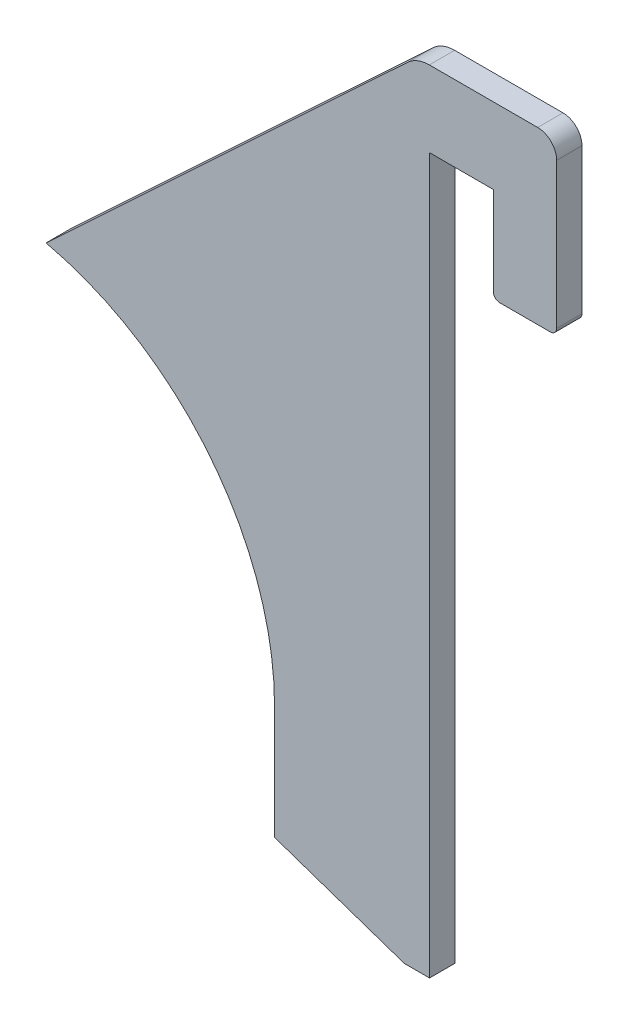
ISO-10303-21;
HEADER;
FILE_DESCRIPTION(('STEP AP214'),'2;1');
FILE_NAME('part.step','',(''),(''),'','','');
FILE_SCHEMA(('AUTOMOTIVE_DESIGN { 1 0 10303 214 1 1 1 1 }'));
ENDSEC;
DATA;
#1=APPLICATION_CONTEXT('core data for automotive mechanical design processes');
#2=APPLICATION_PROTOCOL_DEFINITION('international standard','automotive_design',2000,#1);
#3=PRODUCT_CONTEXT('',#1,'mechanical');
#4=PRODUCT('Part','Part','',(#3));
#5=PRODUCT_RELATED_PRODUCT_CATEGORY('part','',(#4));
#6=PRODUCT_DEFINITION_FORMATION('','',#4);
#7=PRODUCT_DEFINITION_CONTEXT('part definition',#1,'design');
#8=PRODUCT_DEFINITION('design','',#6,#7);
#9=PRODUCT_DEFINITION_SHAPE('','',#8);
#10=(LENGTH_UNIT() NAMED_UNIT(*) SI_UNIT(.MILLI.,.METRE.));
#11=(NAMED_UNIT(*) PLANE_ANGLE_UNIT() SI_UNIT($,.RADIAN.));
#12=(NAMED_UNIT(*) SI_UNIT($,.STERADIAN.) SOLID_ANGLE_UNIT());
#13=UNCERTAINTY_MEASURE_WITH_UNIT(LENGTH_MEASURE(1.E-05),#10,'distance_accuracy_value','');
#14=(GEOMETRIC_REPRESENTATION_CONTEXT(3) GLOBAL_UNCERTAINTY_ASSIGNED_CONTEXT((#13)) GLOBAL_UNIT_ASSIGNED_CONTEXT((#10,
#11,#12)) REPRESENTATION_CONTEXT('',''));
#15=CARTESIAN_POINT('',(0.,0.,0.));
#16=DIRECTION('',(0.,0.,1.));
#17=DIRECTION('',(1.,0.,0.));
#18=AXIS2_PLACEMENT_3D('',#15,#16,#17);
#19=CARTESIAN_POINT('',(69.,100.,4.));
#20=DIRECTION('',(0.681998360062503,-0.731353701619167,0.));
#21=DIRECTION('',(0.731353701619167,0.681998360062503,0.));
#22=AXIS2_PLACEMENT_3D('',#19,#20,#21);
#23=PLANE('',#22);
#24=DIRECTION('',(-0.731353701619166,-0.681998360062503,0.));
#25=VECTOR('',#24,1.);
#26=CARTESIAN_POINT('',(69.,100.,4.));
#27=LINE('',#26,#25);
#28=CARTESIAN_POINT('',(67.5595605777622,98.6567685080958,4.));
#29=VERTEX_POINT('',#28);
#30=CARTESIAN_POINT('',(10.3719829262458,45.3284896083872,4.));
#31=VERTEX_POINT('',#30);
#32=EDGE_CURVE('E144',#29,#31,#27,.T.);
#33=ORIENTED_EDGE('',*,*,#32,.F.);
#34=DIRECTION('',(0.,0.,-1.));
#35=VECTOR('',#34,1.);
#36=CARTESIAN_POINT('',(67.5595605777622,98.6567685080958,4.));
#37=LINE('',#36,#35);
#38=CARTESIAN_POINT('',(67.5595605777622,98.6567685080958,0.));
#39=VERTEX_POINT('',#38);
#40=EDGE_CURVE('E12',#29,#39,#37,.T.);
#41=ORIENTED_EDGE('',*,*,#40,.T.);
#42=DIRECTION('',(-0.731353701619166,-0.681998360062503,0.));
#43=VECTOR('',#42,1.);
#44=CARTESIAN_POINT('',(69.,100.,0.));
#45=LINE('',#44,#43);
#46=CARTESIAN_POINT('',(10.3719829262458,45.3284896083872,0.));
#47=VERTEX_POINT('',#46);
#48=EDGE_CURVE('E167',#39,#47,#45,.T.);
#49=ORIENTED_EDGE('',*,*,#48,.T.);
#50=DIRECTION('',(0.,0.,-1.));
#51=VECTOR('',#50,1.);
#52=CARTESIAN_POINT('',(10.3719829262458,45.3284896083872,4.));
#53=LINE('',#52,#51);
#54=EDGE_CURVE('E160',#31,#47,#53,.T.);
#55=ORIENTED_EDGE('',*,*,#54,.F.);
#56=EDGE_LOOP('',(#33,#41,#49,#55));
#57=FACE_BOUND('',#56,.T.);
#58=ADVANCED_FACE('F37',(#57),#23,.F.);
#59=CARTESIAN_POINT('',(0.,0.,4.));
#60=DIRECTION('',(0.,0.,-1.));
#61=DIRECTION('',(-1.,0.,0.));
#62=AXIS2_PLACEMENT_3D('',#59,#60,#61);
#63=CYLINDRICAL_SURFACE('',#62,46.5);
#64=CARTESIAN_POINT('',(0.,0.,0.));
#65=DIRECTION('',(0.,0.,-1.));
#66=DIRECTION('',(-1.,0.,0.));
#67=AXIS2_PLACEMENT_3D('',#64,#65,#66);
#68=CIRCLE('',#67,46.5);
#69=CARTESIAN_POINT('',(46.5,0.,0.));
#70=VERTEX_POINT('',#69);
#71=EDGE_CURVE('E241',#47,#70,#68,.T.);
#72=ORIENTED_EDGE('',*,*,#71,.T.);
#73=DIRECTION('',(0.,0.,-1.));
#74=VECTOR('',#73,1.);
#75=CARTESIAN_POINT('',(46.5,0.,4.));
#76=LINE('',#75,#74);
#77=CARTESIAN_POINT('',(46.5,0.,4.));
#78=VERTEX_POINT('',#77);
#79=EDGE_CURVE('E162',#78,#70,#76,.T.);
#80=ORIENTED_EDGE('',*,*,#79,.F.);
#81=CARTESIAN_POINT('',(0.,0.,4.));
#82=DIRECTION('',(0.,0.,-1.));
#83=DIRECTION('',(-1.,0.,0.));
#84=AXIS2_PLACEMENT_3D('',#81,#82,#83);
#85=CIRCLE('',#84,46.5);
#86=EDGE_CURVE('E148',#31,#78,#85,.T.);
#87=ORIENTED_EDGE('',*,*,#86,.F.);
#88=ORIENTED_EDGE('',*,*,#54,.T.);
#89=EDGE_LOOP('',(#72,#80,#87,#88));
#90=FACE_BOUND('',#89,.T.);
#91=ADVANCED_FACE('F159',(#90),#63,.F.);
#92=CARTESIAN_POINT('',(46.5,0.,4.));
#93=DIRECTION('',(1.,0.,0.));
#94=DIRECTION('',(0.,1.,0.));
#95=AXIS2_PLACEMENT_3D('',#92,#93,#94);
#96=PLANE('',#95);
#97=DIRECTION('',(0.,-1.,0.));
#98=VECTOR('',#97,1.);
#99=CARTESIAN_POINT('',(46.5,0.,0.));
#100=LINE('',#99,#98);
#101=CARTESIAN_POINT('',(46.5,-18.,0.));
#102=VERTEX_POINT('',#101);
#103=EDGE_CURVE('E239',#70,#102,#100,.T.);
#104=ORIENTED_EDGE('',*,*,#103,.T.);
#105=DIRECTION('',(0.,0.,-1.));
#106=VECTOR('',#105,1.);
#107=CARTESIAN_POINT('',(46.5,-18.,4.));
#108=LINE('',#107,#106);
#109=CARTESIAN_POINT('',(46.5,-18.,4.));
#110=VERTEX_POINT('',#109);
#111=EDGE_CURVE('E173',#110,#102,#108,.T.);
#112=ORIENTED_EDGE('',*,*,#111,.F.);
#113=DIRECTION('',(0.,-1.,0.));
#114=VECTOR('',#113,1.);
#115=CARTESIAN_POINT('',(46.5,0.,4.));
#116=LINE('',#115,#114);
#117=EDGE_CURVE('E164',#78,#110,#116,.T.);
#118=ORIENTED_EDGE('',*,*,#117,.F.);
#119=ORIENTED_EDGE('',*,*,#79,.T.);
#120=EDGE_LOOP('',(#104,#112,#118,#119));
#121=FACE_BOUND('',#120,.T.);
#122=ADVANCED_FACE('F240',(#121),#96,.F.);
#123=CARTESIAN_POINT('',(67.,-25.,4.));
#124=DIRECTION('',(-0.323143853291512,-0.946349856067994,0.));
#125=DIRECTION('',(0.946349856067995,-0.323143853291512,0.));
#126=AXIS2_PLACEMENT_3D('',#123,#124,#125);
#127=PLANE('',#126);
#128=DIRECTION('',(-0.946349856067994,0.323143853291512,0.));
#129=VECTOR('',#128,1.);
#130=CARTESIAN_POINT('',(67.,-25.,0.));
#131=LINE('',#130,#129);
#132=CARTESIAN_POINT('',(67.,-25.,0.));
#133=VERTEX_POINT('',#132);
#134=EDGE_CURVE('E234',#133,#102,#131,.T.);
#135=ORIENTED_EDGE('',*,*,#134,.F.);
#136=DIRECTION('',(0.,0.,-1.));
#137=VECTOR('',#136,1.);
#138=CARTESIAN_POINT('',(67.,-25.,4.));
#139=LINE('',#138,#137);
#140=CARTESIAN_POINT('',(67.,-25.,4.));
#141=VERTEX_POINT('',#140);
#142=EDGE_CURVE('E226',#141,#133,#139,.T.);
#143=ORIENTED_EDGE('',*,*,#142,.F.);
#144=DIRECTION('',(-0.946349856067994,0.323143853291512,0.));
#145=VECTOR('',#144,1.);
#146=CARTESIAN_POINT('',(67.,-25.,4.));
#147=LINE('',#146,#145);
#148=EDGE_CURVE('E236',#141,#110,#147,.T.);
#149=ORIENTED_EDGE('',*,*,#148,.T.);
#150=ORIENTED_EDGE('',*,*,#111,.T.);
#151=EDGE_LOOP('',(#135,#143,#149,#150));
#152=FACE_BOUND('',#151,.T.);
#153=ADVANCED_FACE('F232',(#152),#127,.T.);
#154=CARTESIAN_POINT('',(67.,-25.,4.));
#155=DIRECTION('',(0.,1.,0.));
#156=DIRECTION('',(-1.,0.,0.));
#157=AXIS2_PLACEMENT_3D('',#154,#155,#156);
#158=PLANE('',#157);
#159=DIRECTION('',(1.,0.,0.));
#160=VECTOR('',#159,1.);
#161=CARTESIAN_POINT('',(67.,-25.,0.));
#162=LINE('',#161,#160);
#163=CARTESIAN_POINT('',(71.,-25.,0.));
#164=VERTEX_POINT('',#163);
#165=EDGE_CURVE('E245',#133,#164,#162,.T.);
#166=ORIENTED_EDGE('',*,*,#165,.T.);
#167=DIRECTION('',(0.,0.,-1.));
#168=VECTOR('',#167,1.);
#169=CARTESIAN_POINT('',(71.,-25.,4.));
#170=LINE('',#169,#168);
#171=CARTESIAN_POINT('',(71.,-25.,4.));
#172=VERTEX_POINT('',#171);
#173=EDGE_CURVE('E223',#172,#164,#170,.T.);
#174=ORIENTED_EDGE('',*,*,#173,.F.);
#175=DIRECTION('',(1.,0.,0.));
#176=VECTOR('',#175,1.);
#177=CARTESIAN_POINT('',(67.,-25.,4.));
#178=LINE('',#177,#176);
#179=EDGE_CURVE('E284',#141,#172,#178,.T.);
#180=ORIENTED_EDGE('',*,*,#179,.F.);
#181=ORIENTED_EDGE('',*,*,#142,.T.);
#182=EDGE_LOOP('',(#166,#174,#180,#181));
#183=FACE_BOUND('',#182,.T.);
#184=ADVANCED_FACE('F292',(#183),#158,.F.);
#185=CARTESIAN_POINT('',(71.,-25.,4.));
#186=DIRECTION('',(-1.,0.,0.));
#187=DIRECTION('',(0.,0.,1.));
#188=AXIS2_PLACEMENT_3D('',#185,#186,#187);
#189=PLANE('',#188);
#190=DIRECTION('',(0.,1.,0.));
#191=VECTOR('',#190,1.);
#192=CARTESIAN_POINT('',(71.,-25.,0.));
#193=LINE('',#192,#191);
#194=CARTESIAN_POINT('',(71.,88.,0.));
#195=VERTEX_POINT('',#194);
#196=EDGE_CURVE('E247',#164,#195,#193,.T.);
#197=ORIENTED_EDGE('',*,*,#196,.T.);
#198=DIRECTION('',(0.,0.,-1.));
#199=VECTOR('',#198,1.);
#200=CARTESIAN_POINT('',(71.,88.,4.));
#201=LINE('',#200,#199);
#202=CARTESIAN_POINT('',(71.,88.,4.));
#203=VERTEX_POINT('',#202);
#204=EDGE_CURVE('E220',#203,#195,#201,.T.);
#205=ORIENTED_EDGE('',*,*,#204,.F.);
#206=DIRECTION('',(0.,1.,0.));
#207=VECTOR('',#206,1.);
#208=CARTESIAN_POINT('',(71.,-25.,4.));
#209=LINE('',#208,#207);
#210=EDGE_CURVE('E282',#172,#203,#209,.T.);
#211=ORIENTED_EDGE('',*,*,#210,.F.);
#212=ORIENTED_EDGE('',*,*,#173,.T.);
#213=EDGE_LOOP('',(#197,#205,#211,#212));
#214=FACE_BOUND('',#213,.T.);
#215=ADVANCED_FACE('F294',(#214),#189,.F.);
#216=CARTESIAN_POINT('',(71.,88.,4.));
#217=DIRECTION('',(0.,1.,0.));
#218=DIRECTION('',(0.,0.,1.));
#219=AXIS2_PLACEMENT_3D('',#216,#217,#218);
#220=PLANE('',#219);
#221=DIRECTION('',(1.,0.,0.));
#222=VECTOR('',#221,1.);
#223=CARTESIAN_POINT('',(71.,88.,0.));
#224=LINE('',#223,#222);
#225=CARTESIAN_POINT('',(81.1,88.,0.));
#226=VERTEX_POINT('',#225);
#227=EDGE_CURVE('E252',#195,#226,#224,.T.);
#228=ORIENTED_EDGE('',*,*,#227,.T.);
#229=DIRECTION('',(0.,0.,-1.));
#230=VECTOR('',#229,1.);
#231=CARTESIAN_POINT('',(81.1,88.,4.));
#232=LINE('',#231,#230);
#233=CARTESIAN_POINT('',(81.1,88.,4.));
#234=VERTEX_POINT('',#233);
#235=EDGE_CURVE('E217',#234,#226,#232,.T.);
#236=ORIENTED_EDGE('',*,*,#235,.F.);
#237=DIRECTION('',(1.,0.,0.));
#238=VECTOR('',#237,1.);
#239=CARTESIAN_POINT('',(71.,88.,4.));
#240=LINE('',#239,#238);
#241=EDGE_CURVE('E280',#203,#234,#240,.T.);
#242=ORIENTED_EDGE('',*,*,#241,.F.);
#243=ORIENTED_EDGE('',*,*,#204,.T.);
#244=EDGE_LOOP('',(#228,#236,#242,#243));
#245=FACE_BOUND('',#244,.T.);
#246=ADVANCED_FACE('F299',(#245),#220,.F.);
#247=CARTESIAN_POINT('',(81.1,88.,4.));
#248=DIRECTION('',(1.,0.,0.));
#249=DIRECTION('',(0.,0.,-1.));
#250=AXIS2_PLACEMENT_3D('',#247,#248,#249);
#251=PLANE('',#250);
#252=DIRECTION('',(0.,-1.,0.));
#253=VECTOR('',#252,1.);
#254=CARTESIAN_POINT('',(81.1,88.,0.));
#255=LINE('',#254,#253);
#256=CARTESIAN_POINT('',(81.1,74.,0.));
#257=VERTEX_POINT('',#256);
#258=EDGE_CURVE('E254',#226,#257,#255,.T.);
#259=ORIENTED_EDGE('',*,*,#258,.T.);
#260=DIRECTION('',(0.,0.,-1.));
#261=VECTOR('',#260,1.);
#262=CARTESIAN_POINT('',(81.1,74.,4.));
#263=LINE('',#262,#261);
#264=CARTESIAN_POINT('',(81.1,74.,4.));
#265=VERTEX_POINT('',#264);
#266=EDGE_CURVE('E187',#257,#265,#263,.F.);
#267=ORIENTED_EDGE('',*,*,#266,.T.);
#268=DIRECTION('',(0.,-1.,0.));
#269=VECTOR('',#268,1.);
#270=CARTESIAN_POINT('',(81.1,88.,4.));
#271=LINE('',#270,#269);
#272=EDGE_CURVE('E275',#234,#265,#271,.T.);
#273=ORIENTED_EDGE('',*,*,#272,.F.);
#274=ORIENTED_EDGE('',*,*,#235,.T.);
#275=EDGE_LOOP('',(#259,#267,#273,#274));
#276=FACE_BOUND('',#275,.T.);
#277=ADVANCED_FACE('F307',(#276),#251,.F.);
#278=CARTESIAN_POINT('',(81.1,73.,4.));
#279=DIRECTION('',(0.,1.,0.));
#280=DIRECTION('',(-1.,0.,0.));
#281=AXIS2_PLACEMENT_3D('',#278,#279,#280);
#282=PLANE('',#281);
#283=DIRECTION('',(1.,0.,0.));
#284=VECTOR('',#283,1.);
#285=CARTESIAN_POINT('',(81.1,73.,4.));
#286=LINE('',#285,#284);
#287=CARTESIAN_POINT('',(82.1,73.,4.));
#288=VERTEX_POINT('',#287);
#289=CARTESIAN_POINT('',(90.1,73.,4.));
#290=VERTEX_POINT('',#289);
#291=EDGE_CURVE('E269',#288,#290,#286,.T.);
#292=ORIENTED_EDGE('',*,*,#291,.F.);
#293=DIRECTION('',(0.,0.,-1.));
#294=VECTOR('',#293,1.);
#295=CARTESIAN_POINT('',(82.1,73.,4.));
#296=LINE('',#295,#294);
#297=CARTESIAN_POINT('',(82.1,73.,0.));
#298=VERTEX_POINT('',#297);
#299=EDGE_CURVE('E171',#288,#298,#296,.T.);
#300=ORIENTED_EDGE('',*,*,#299,.T.);
#301=DIRECTION('',(1.,0.,0.));
#302=VECTOR('',#301,1.);
#303=CARTESIAN_POINT('',(81.1,73.,0.));
#304=LINE('',#303,#302);
#305=CARTESIAN_POINT('',(90.1,73.,0.));
#306=VERTEX_POINT('',#305);
#307=EDGE_CURVE('E213',#298,#306,#304,.T.);
#308=ORIENTED_EDGE('',*,*,#307,.T.);
#309=DIRECTION('',(0.,0.,-1.));
#310=VECTOR('',#309,1.);
#311=CARTESIAN_POINT('',(90.1,73.,4.));
#312=LINE('',#311,#310);
#313=EDGE_CURVE('E169',#306,#290,#312,.F.);
#314=ORIENTED_EDGE('',*,*,#313,.T.);
#315=EDGE_LOOP('',(#292,#300,#308,#314));
#316=FACE_BOUND('',#315,.T.);
#317=ADVANCED_FACE('F260',(#316),#282,.F.);
#318=CARTESIAN_POINT('',(91.1,73.,4.));
#319=DIRECTION('',(-1.,0.,0.));
#320=DIRECTION('',(0.,0.,1.));
#321=AXIS2_PLACEMENT_3D('',#318,#319,#320);
#322=PLANE('',#321);
#323=DIRECTION('',(0.,1.,0.));
#324=VECTOR('',#323,1.);
#325=CARTESIAN_POINT('',(91.1,73.,4.));
#326=LINE('',#325,#324);
#327=CARTESIAN_POINT('',(91.1,74.,4.));
#328=VERTEX_POINT('',#327);
#329=CARTESIAN_POINT('',(91.1,97.,4.));
#330=VERTEX_POINT('',#329);
#331=EDGE_CURVE('E268',#328,#330,#326,.T.);
#332=ORIENTED_EDGE('',*,*,#331,.F.);
#333=DIRECTION('',(0.,0.,-1.));
#334=VECTOR('',#333,1.);
#335=CARTESIAN_POINT('',(91.1,74.,4.));
#336=LINE('',#335,#334);
#337=CARTESIAN_POINT('',(91.1,74.,0.));
#338=VERTEX_POINT('',#337);
#339=EDGE_CURVE('E197',#328,#338,#336,.T.);
#340=ORIENTED_EDGE('',*,*,#339,.T.);
#341=DIRECTION('',(0.,1.,0.));
#342=VECTOR('',#341,1.);
#343=CARTESIAN_POINT('',(91.1,73.,0.));
#344=LINE('',#343,#342);
#345=CARTESIAN_POINT('',(91.1,97.,0.));
#346=VERTEX_POINT('',#345);
#347=EDGE_CURVE('E211',#338,#346,#344,.T.);
#348=ORIENTED_EDGE('',*,*,#347,.T.);
#349=DIRECTION('',(0.,0.,-1.));
#350=VECTOR('',#349,1.);
#351=CARTESIAN_POINT('',(91.1,97.,4.));
#352=LINE('',#351,#350);
#353=EDGE_CURVE('E195',#346,#330,#352,.F.);
#354=ORIENTED_EDGE('',*,*,#353,.T.);
#355=EDGE_LOOP('',(#332,#340,#348,#354));
#356=FACE_BOUND('',#355,.T.);
#357=ADVANCED_FACE('F271',(#356),#322,.F.);
#358=CARTESIAN_POINT('',(91.1,100.,4.));
#359=DIRECTION('',(0.,-1.,0.));
#360=DIRECTION('',(1.,0.,0.));
#361=AXIS2_PLACEMENT_3D('',#358,#359,#360);
#362=PLANE('',#361);
#363=DIRECTION('',(-1.,0.,0.));
#364=VECTOR('',#363,1.);
#365=CARTESIAN_POINT('',(91.1,100.,4.));
#366=LINE('',#365,#364);
#367=CARTESIAN_POINT('',(88.1,100.,4.));
#368=VERTEX_POINT('',#367);
#369=CARTESIAN_POINT('',(70.9695523780747,100.,4.));
#370=VERTEX_POINT('',#369);
#371=EDGE_CURVE('E204',#368,#370,#366,.T.);
#372=ORIENTED_EDGE('',*,*,#371,.F.);
#373=DIRECTION('',(0.,0.,-1.));
#374=VECTOR('',#373,1.);
#375=CARTESIAN_POINT('',(88.1,100.,4.));
#376=LINE('',#375,#374);
#377=CARTESIAN_POINT('',(88.1,100.,0.));
#378=VERTEX_POINT('',#377);
#379=EDGE_CURVE('E45',#368,#378,#376,.T.);
#380=ORIENTED_EDGE('',*,*,#379,.T.);
#381=DIRECTION('',(-1.,0.,0.));
#382=VECTOR('',#381,1.);
#383=CARTESIAN_POINT('',(91.1,100.,0.));
#384=LINE('',#383,#382);
#385=CARTESIAN_POINT('',(70.9695523780747,100.,0.));
#386=VERTEX_POINT('',#385);
#387=EDGE_CURVE('E155',#378,#386,#384,.T.);
#388=ORIENTED_EDGE('',*,*,#387,.T.);
#389=DIRECTION('',(0.,0.,-1.));
#390=VECTOR('',#389,1.);
#391=CARTESIAN_POINT('',(70.9695523780747,100.,4.));
#392=LINE('',#391,#390);
#393=EDGE_CURVE('E52',#386,#370,#392,.F.);
#394=ORIENTED_EDGE('',*,*,#393,.T.);
#395=EDGE_LOOP('',(#372,#380,#388,#394));
#396=FACE_BOUND('',#395,.T.);
#397=ADVANCED_FACE('F203',(#396),#362,.F.);
#398=CARTESIAN_POINT('',(0.,0.,4.));
#399=DIRECTION('',(0.,0.,-1.));
#400=DIRECTION('',(-1.,0.,0.));
#401=AXIS2_PLACEMENT_3D('',#398,#399,#400);
#402=PLANE('',#401);
#403=ORIENTED_EDGE('',*,*,#272,.T.);
#404=CARTESIAN_POINT('',(82.1,74.,4.));
#405=DIRECTION('',(0.,0.,-1.));
#406=DIRECTION('',(-1.,0.,0.));
#407=AXIS2_PLACEMENT_3D('',#404,#405,#406);
#408=CIRCLE('',#407,1.);
#409=EDGE_CURVE('E193',#265,#288,#408,.F.);
#410=ORIENTED_EDGE('',*,*,#409,.T.);
#411=ORIENTED_EDGE('',*,*,#291,.T.);
#412=CARTESIAN_POINT('',(90.1,74.,4.));
#413=DIRECTION('',(0.,0.,-1.));
#414=DIRECTION('',(-1.,0.,0.));
#415=AXIS2_PLACEMENT_3D('',#412,#413,#414);
#416=CIRCLE('',#415,1.);
#417=EDGE_CURVE('E191',#290,#328,#416,.F.);
#418=ORIENTED_EDGE('',*,*,#417,.T.);
#419=ORIENTED_EDGE('',*,*,#331,.T.);
#420=CARTESIAN_POINT('',(88.1,97.,4.));
#421=DIRECTION('',(0.,0.,-1.));
#422=DIRECTION('',(-1.,0.,0.));
#423=AXIS2_PLACEMENT_3D('',#420,#421,#422);
#424=CIRCLE('',#423,3.);
#425=EDGE_CURVE('E59',#330,#368,#424,.F.);
#426=ORIENTED_EDGE('',*,*,#425,.T.);
#427=ORIENTED_EDGE('',*,*,#371,.T.);
#428=CARTESIAN_POINT('',(70.9695523780747,95.,4.));
#429=DIRECTION('',(0.,0.,-1.));
#430=DIRECTION('',(-1.,0.,0.));
#431=AXIS2_PLACEMENT_3D('',#428,#429,#430);
#432=CIRCLE('',#431,5.);
#433=EDGE_CURVE('E151',#370,#29,#432,.F.);
#434=ORIENTED_EDGE('',*,*,#433,.T.);
#435=ORIENTED_EDGE('',*,*,#32,.T.);
#436=ORIENTED_EDGE('',*,*,#86,.T.);
#437=ORIENTED_EDGE('',*,*,#117,.T.);
#438=ORIENTED_EDGE('',*,*,#148,.F.);
#439=ORIENTED_EDGE('',*,*,#179,.T.);
#440=ORIENTED_EDGE('',*,*,#210,.T.);
#441=ORIENTED_EDGE('',*,*,#241,.T.);
#442=EDGE_LOOP('',(#403,#410,#411,#418,#419,#426,#427,#434,#435,#436,#437,#438,#439,#440,#441));
#443=FACE_BOUND('',#442,.T.);
#444=ADVANCED_FACE('F147',(#443),#402,.F.);
#445=CARTESIAN_POINT('',(0.,0.,0.));
#446=DIRECTION('',(0.,0.,-1.));
#447=DIRECTION('',(-1.,0.,0.));
#448=AXIS2_PLACEMENT_3D('',#445,#446,#447);
#449=PLANE('',#448);
#450=ORIENTED_EDGE('',*,*,#307,.F.);
#451=CARTESIAN_POINT('',(82.1,74.,0.));
#452=DIRECTION('',(0.,0.,-1.));
#453=DIRECTION('',(-1.,0.,0.));
#454=AXIS2_PLACEMENT_3D('',#451,#452,#453);
#455=CIRCLE('',#454,1.);
#456=EDGE_CURVE('E185',#298,#257,#455,.T.);
#457=ORIENTED_EDGE('',*,*,#456,.T.);
#458=ORIENTED_EDGE('',*,*,#258,.F.);
#459=ORIENTED_EDGE('',*,*,#227,.F.);
#460=ORIENTED_EDGE('',*,*,#196,.F.);
#461=ORIENTED_EDGE('',*,*,#165,.F.);
#462=ORIENTED_EDGE('',*,*,#134,.T.);
#463=ORIENTED_EDGE('',*,*,#103,.F.);
#464=ORIENTED_EDGE('',*,*,#71,.F.);
#465=ORIENTED_EDGE('',*,*,#48,.F.);
#466=CARTESIAN_POINT('',(70.9695523780747,95.,0.));
#467=DIRECTION('',(0.,0.,-1.));
#468=DIRECTION('',(-1.,0.,0.));
#469=AXIS2_PLACEMENT_3D('',#466,#467,#468);
#470=CIRCLE('',#469,5.);
#471=EDGE_CURVE('E179',#39,#386,#470,.T.);
#472=ORIENTED_EDGE('',*,*,#471,.T.);
#473=ORIENTED_EDGE('',*,*,#387,.F.);
#474=CARTESIAN_POINT('',(88.1,97.,0.));
#475=DIRECTION('',(0.,0.,-1.));
#476=DIRECTION('',(-1.,0.,0.));
#477=AXIS2_PLACEMENT_3D('',#474,#475,#476);
#478=CIRCLE('',#477,3.);
#479=EDGE_CURVE('E181',#378,#346,#478,.T.);
#480=ORIENTED_EDGE('',*,*,#479,.T.);
#481=ORIENTED_EDGE('',*,*,#347,.F.);
#482=CARTESIAN_POINT('',(90.1,74.,0.));
#483=DIRECTION('',(0.,0.,-1.));
#484=DIRECTION('',(-1.,0.,0.));
#485=AXIS2_PLACEMENT_3D('',#482,#483,#484);
#486=CIRCLE('',#485,1.);
#487=EDGE_CURVE('E183',#338,#306,#486,.T.);
#488=ORIENTED_EDGE('',*,*,#487,.T.);
#489=EDGE_LOOP('',(#450,#457,#458,#459,#460,#461,#462,#463,#464,#465,#472,#473,#480,#481,#488));
#490=FACE_BOUND('',#489,.T.);
#491=ADVANCED_FACE('F208',(#490),#449,.T.);
#492=CARTESIAN_POINT('',(82.1,74.,4.));
#493=DIRECTION('',(0.,0.,-1.));
#494=DIRECTION('',(-1.,0.,0.));
#495=AXIS2_PLACEMENT_3D('',#492,#493,#494);
#496=CYLINDRICAL_SURFACE('',#495,1.);
#497=ORIENTED_EDGE('',*,*,#409,.F.);
#498=ORIENTED_EDGE('',*,*,#266,.F.);
#499=ORIENTED_EDGE('',*,*,#456,.F.);
#500=ORIENTED_EDGE('',*,*,#299,.F.);
#501=EDGE_LOOP('',(#497,#498,#499,#500));
#502=FACE_BOUND('',#501,.T.);
#503=ADVANCED_FACE('F305',(#502),#496,.T.);
#504=CARTESIAN_POINT('',(90.1,74.,4.));
#505=DIRECTION('',(0.,0.,-1.));
#506=DIRECTION('',(-1.,0.,0.));
#507=AXIS2_PLACEMENT_3D('',#504,#505,#506);
#508=CYLINDRICAL_SURFACE('',#507,1.);
#509=ORIENTED_EDGE('',*,*,#417,.F.);
#510=ORIENTED_EDGE('',*,*,#313,.F.);
#511=ORIENTED_EDGE('',*,*,#487,.F.);
#512=ORIENTED_EDGE('',*,*,#339,.F.);
#513=EDGE_LOOP('',(#509,#510,#511,#512));
#514=FACE_BOUND('',#513,.T.);
#515=ADVANCED_FACE('F265',(#514),#508,.T.);
#516=CARTESIAN_POINT('',(88.1,97.,4.));
#517=DIRECTION('',(0.,0.,-1.));
#518=DIRECTION('',(-1.,0.,0.));
#519=AXIS2_PLACEMENT_3D('',#516,#517,#518);
#520=CYLINDRICAL_SURFACE('',#519,3.);
#521=ORIENTED_EDGE('',*,*,#425,.F.);
#522=ORIENTED_EDGE('',*,*,#353,.F.);
#523=ORIENTED_EDGE('',*,*,#479,.F.);
#524=ORIENTED_EDGE('',*,*,#379,.F.);
#525=EDGE_LOOP('',(#521,#522,#523,#524));
#526=FACE_BOUND('',#525,.T.);
#527=ADVANCED_FACE('F327',(#526),#520,.T.);
#528=CARTESIAN_POINT('',(70.9695523780747,95.,4.));
#529=DIRECTION('',(0.,0.,-1.));
#530=DIRECTION('',(-1.,0.,0.));
#531=AXIS2_PLACEMENT_3D('',#528,#529,#530);
#532=CYLINDRICAL_SURFACE('',#531,5.);
#533=ORIENTED_EDGE('',*,*,#433,.F.);
#534=ORIENTED_EDGE('',*,*,#393,.F.);
#535=ORIENTED_EDGE('',*,*,#471,.F.);
#536=ORIENTED_EDGE('',*,*,#40,.F.);
#537=EDGE_LOOP('',(#533,#534,#535,#536));
#538=FACE_BOUND('',#537,.T.);
#539=ADVANCED_FACE('F39',(#538),#532,.T.);
#540=CLOSED_SHELL('',(#58,#91,#122,#153,#184,#215,#246,#277,#317,#357,#397,#444,#491,#503,#515,
#527,#539));
#541=MANIFOLD_SOLID_BREP('B2',#540);
#542=ADVANCED_BREP_SHAPE_REPRESENTATION('',(#18,#541),#14);
#543=SHAPE_DEFINITION_REPRESENTATION(#9,#542);
ENDSEC;
END-ISO-10303-21;
